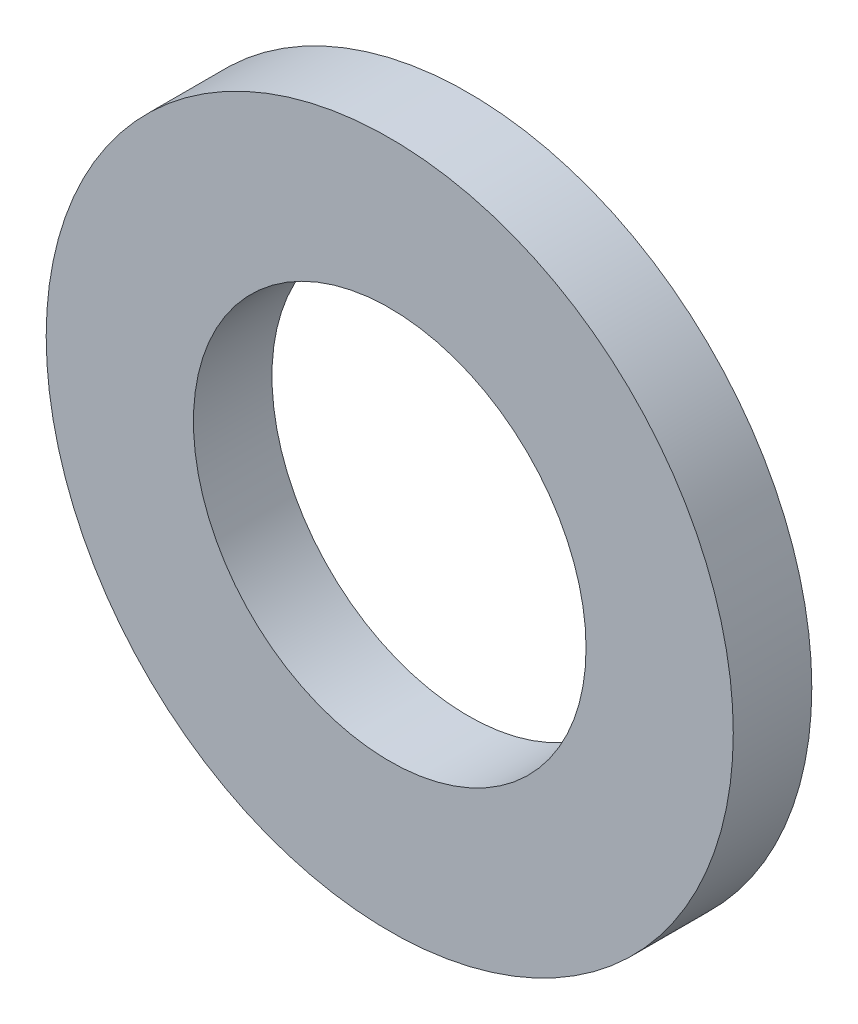
ISO-10303-21;
HEADER;
FILE_DESCRIPTION(('STEP AP214'),'2;1');
FILE_NAME('part.step','',(''),(''),'','','');
FILE_SCHEMA(('AUTOMOTIVE_DESIGN { 1 0 10303 214 1 1 1 1 }'));
ENDSEC;
DATA;
#1=APPLICATION_CONTEXT('core data for automotive mechanical design processes');
#2=APPLICATION_PROTOCOL_DEFINITION('international standard','automotive_design',2000,#1);
#3=PRODUCT_CONTEXT('',#1,'mechanical');
#4=PRODUCT('Part','Part','',(#3));
#5=PRODUCT_RELATED_PRODUCT_CATEGORY('part','',(#4));
#6=PRODUCT_DEFINITION_FORMATION('','',#4);
#7=PRODUCT_DEFINITION_CONTEXT('part definition',#1,'design');
#8=PRODUCT_DEFINITION('design','',#6,#7);
#9=PRODUCT_DEFINITION_SHAPE('','',#8);
#10=(LENGTH_UNIT() NAMED_UNIT(*) SI_UNIT(.MILLI.,.METRE.));
#11=(NAMED_UNIT(*) PLANE_ANGLE_UNIT() SI_UNIT($,.RADIAN.));
#12=(NAMED_UNIT(*) SI_UNIT($,.STERADIAN.) SOLID_ANGLE_UNIT());
#13=UNCERTAINTY_MEASURE_WITH_UNIT(LENGTH_MEASURE(1.E-05),#10,'distance_accuracy_value','');
#14=(GEOMETRIC_REPRESENTATION_CONTEXT(3) GLOBAL_UNCERTAINTY_ASSIGNED_CONTEXT((#13)) GLOBAL_UNIT_ASSIGNED_CONTEXT((#10,
#11,#12)) REPRESENTATION_CONTEXT('',''));
#15=CARTESIAN_POINT('',(0.,0.,0.));
#16=DIRECTION('',(0.,0.,1.));
#17=DIRECTION('',(1.,0.,0.));
#18=AXIS2_PLACEMENT_3D('',#15,#16,#17);
#19=CARTESIAN_POINT('',(0.,0.,4.));
#20=DIRECTION('',(0.,0.,1.));
#21=DIRECTION('',(1.,0.,0.));
#22=AXIS2_PLACEMENT_3D('',#19,#20,#21);
#23=PLANE('',#22);
#24=CARTESIAN_POINT('',(0.,0.,4.));
#25=DIRECTION('',(0.,0.,1.));
#26=DIRECTION('',(1.,0.,0.));
#27=AXIS2_PLACEMENT_3D('',#24,#25,#26);
#28=CIRCLE('',#27,17.5);
#29=CARTESIAN_POINT('',(17.5,0.,4.));
#30=VERTEX_POINT('',#29);
#31=EDGE_CURVE('E10',#30,#30,#28,.T.);
#32=ORIENTED_EDGE('',*,*,#31,.T.);
#33=EDGE_LOOP('',(#32));
#34=FACE_BOUND('',#33,.T.);
#35=CARTESIAN_POINT('',(0.,0.,4.));
#36=DIRECTION('',(0.,0.,1.));
#37=DIRECTION('',(1.,0.,0.));
#38=AXIS2_PLACEMENT_3D('',#35,#36,#37);
#39=CIRCLE('',#38,10.);
#40=CARTESIAN_POINT('',(10.,0.,4.));
#41=VERTEX_POINT('',#40);
#42=EDGE_CURVE('E43',#41,#41,#39,.T.);
#43=ORIENTED_EDGE('',*,*,#42,.F.);
#44=EDGE_LOOP('',(#43));
#45=FACE_BOUND('',#44,.T.);
#46=ADVANCED_FACE('F32',(#34,#45),#23,.T.);
#47=CARTESIAN_POINT('',(0.,0.,0.));
#48=DIRECTION('',(0.,0.,1.));
#49=DIRECTION('',(1.,0.,0.));
#50=AXIS2_PLACEMENT_3D('',#47,#48,#49);
#51=PLANE('',#50);
#52=CARTESIAN_POINT('',(0.,0.,0.));
#53=DIRECTION('',(0.,0.,1.));
#54=DIRECTION('',(1.,0.,0.));
#55=AXIS2_PLACEMENT_3D('',#52,#53,#54);
#56=CIRCLE('',#55,17.5);
#57=CARTESIAN_POINT('',(17.5,0.,0.));
#58=VERTEX_POINT('',#57);
#59=EDGE_CURVE('E36',#58,#58,#56,.T.);
#60=ORIENTED_EDGE('',*,*,#59,.F.);
#61=EDGE_LOOP('',(#60));
#62=FACE_BOUND('',#61,.T.);
#63=CARTESIAN_POINT('',(0.,0.,0.));
#64=DIRECTION('',(0.,0.,1.));
#65=DIRECTION('',(1.,0.,0.));
#66=AXIS2_PLACEMENT_3D('',#63,#64,#65);
#67=CIRCLE('',#66,10.);
#68=CARTESIAN_POINT('',(10.,0.,0.));
#69=VERTEX_POINT('',#68);
#70=EDGE_CURVE('E45',#69,#69,#67,.T.);
#71=ORIENTED_EDGE('',*,*,#70,.T.);
#72=EDGE_LOOP('',(#71));
#73=FACE_BOUND('',#72,.T.);
#74=ADVANCED_FACE('F55',(#62,#73),#51,.F.);
#75=CARTESIAN_POINT('',(0.,0.,4.));
#76=DIRECTION('',(0.,0.,-1.));
#77=DIRECTION('',(-1.,0.,0.));
#78=AXIS2_PLACEMENT_3D('',#75,#76,#77);
#79=CYLINDRICAL_SURFACE('',#78,17.5);
#80=ORIENTED_EDGE('',*,*,#31,.F.);
#81=EDGE_LOOP('',(#80));
#82=FACE_BOUND('',#81,.T.);
#83=ORIENTED_EDGE('',*,*,#59,.T.);
#84=EDGE_LOOP('',(#83));
#85=FACE_BOUND('',#84,.T.);
#86=ADVANCED_FACE('F34',(#82,#85),#79,.T.);
#87=CARTESIAN_POINT('',(0.,0.,4.));
#88=DIRECTION('',(0.,0.,-1.));
#89=DIRECTION('',(-1.,0.,0.));
#90=AXIS2_PLACEMENT_3D('',#87,#88,#89);
#91=CYLINDRICAL_SURFACE('',#90,10.);
#92=ORIENTED_EDGE('',*,*,#42,.T.);
#93=EDGE_LOOP('',(#92));
#94=FACE_BOUND('',#93,.T.);
#95=ORIENTED_EDGE('',*,*,#70,.F.);
#96=EDGE_LOOP('',(#95));
#97=FACE_BOUND('',#96,.T.);
#98=ADVANCED_FACE('F51',(#94,#97),#91,.F.);
#99=CLOSED_SHELL('',(#46,#74,#86,#98));
#100=MANIFOLD_SOLID_BREP('B2',#99);
#101=ADVANCED_BREP_SHAPE_REPRESENTATION('',(#18,#100),#14);
#102=SHAPE_DEFINITION_REPRESENTATION(#9,#101);
ENDSEC;
END-ISO-10303-21;
